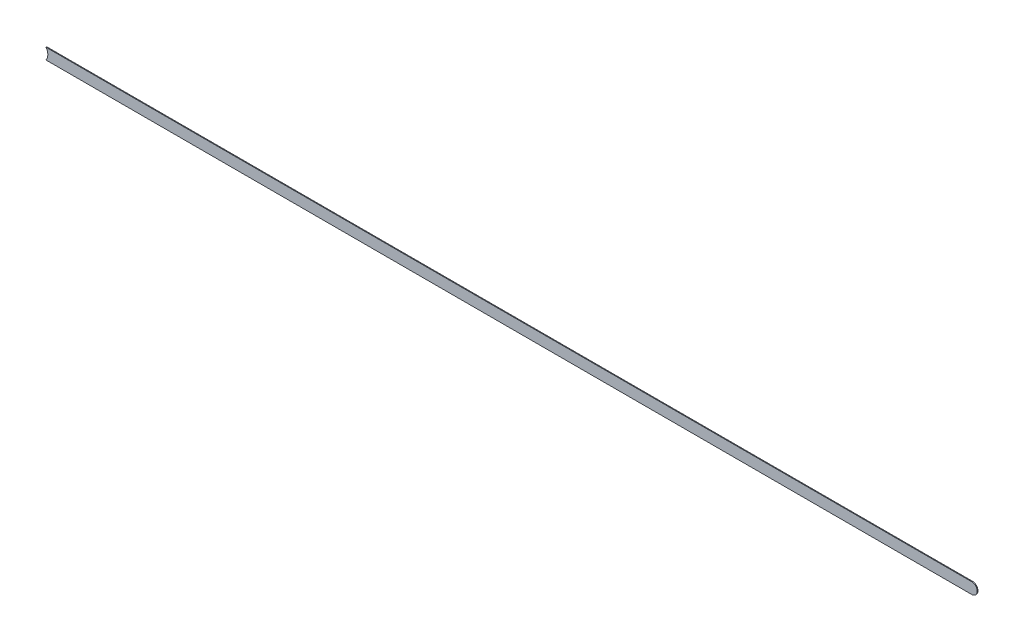
ISO-10303-21;
HEADER;
FILE_DESCRIPTION(('STEP AP214'),'2;1');
FILE_NAME('part.step','',(''),(''),'','','');
FILE_SCHEMA(('AUTOMOTIVE_DESIGN { 1 0 10303 214 1 1 1 1 }'));
ENDSEC;
DATA;
#1=APPLICATION_CONTEXT('core data for automotive mechanical design processes');
#2=APPLICATION_PROTOCOL_DEFINITION('international standard','automotive_design',2000,#1);
#3=PRODUCT_CONTEXT('',#1,'mechanical');
#4=PRODUCT('Part','Part','',(#3));
#5=PRODUCT_RELATED_PRODUCT_CATEGORY('part','',(#4));
#6=PRODUCT_DEFINITION_FORMATION('','',#4);
#7=PRODUCT_DEFINITION_CONTEXT('part definition',#1,'design');
#8=PRODUCT_DEFINITION('design','',#6,#7);
#9=PRODUCT_DEFINITION_SHAPE('','',#8);
#10=(LENGTH_UNIT() NAMED_UNIT(*) SI_UNIT(.MILLI.,.METRE.));
#11=(NAMED_UNIT(*) PLANE_ANGLE_UNIT() SI_UNIT($,.RADIAN.));
#12=(NAMED_UNIT(*) SI_UNIT($,.STERADIAN.) SOLID_ANGLE_UNIT());
#13=UNCERTAINTY_MEASURE_WITH_UNIT(LENGTH_MEASURE(1.E-05),#10,'distance_accuracy_value','');
#14=(GEOMETRIC_REPRESENTATION_CONTEXT(3) GLOBAL_UNCERTAINTY_ASSIGNED_CONTEXT((#13)) GLOBAL_UNIT_ASSIGNED_CONTEXT((#10,
#11,#12)) REPRESENTATION_CONTEXT('',''));
#15=CARTESIAN_POINT('',(0.,0.,0.));
#16=DIRECTION('',(0.,0.,1.));
#17=DIRECTION('',(1.,0.,0.));
#18=AXIS2_PLACEMENT_3D('',#15,#16,#17);
#19=CARTESIAN_POINT('',(120.645,-153.499,-0.035));
#20=DIRECTION('',(0.,1.,0.));
#21=DIRECTION('',(1.,0.,0.));
#22=AXIS2_PLACEMENT_3D('',#19,#20,#21);
#23=PLANE('',#22);
#24=DIRECTION('',(0.,0.,1.));
#25=VECTOR('',#24,1.);
#26=CARTESIAN_POINT('',(162.727,-153.499,-0.035));
#27=LINE('',#26,#25);
#28=CARTESIAN_POINT('',(162.727,-153.499,-0.035));
#29=VERTEX_POINT('',#28);
#30=CARTESIAN_POINT('',(162.727,-153.499,0.));
#31=VERTEX_POINT('',#30);
#32=EDGE_CURVE('E11',#29,#31,#27,.T.);
#33=ORIENTED_EDGE('',*,*,#32,.T.);
#34=DIRECTION('',(1.,0.,0.));
#35=VECTOR('',#34,1.);
#36=CARTESIAN_POINT('',(120.645,-153.499,0.));
#37=LINE('',#36,#35);
#38=CARTESIAN_POINT('',(120.98869317713,-153.499,0.));
#39=VERTEX_POINT('',#38);
#40=EDGE_CURVE('E25',#39,#31,#37,.T.);
#41=ORIENTED_EDGE('',*,*,#40,.F.);
#42=DIRECTION('',(0.,0.,-1.));
#43=VECTOR('',#42,1.);
#44=CARTESIAN_POINT('',(120.98869317712,-153.499,-0.045));
#45=LINE('',#44,#43);
#46=CARTESIAN_POINT('',(120.98869317713,-153.499,-0.035));
#47=VERTEX_POINT('',#46);
#48=EDGE_CURVE('E64',#39,#47,#45,.T.);
#49=ORIENTED_EDGE('',*,*,#48,.T.);
#50=DIRECTION('',(1.,0.,0.));
#51=VECTOR('',#50,1.);
#52=CARTESIAN_POINT('',(120.645,-153.499,-0.035));
#53=LINE('',#52,#51);
#54=EDGE_CURVE('E67',#47,#29,#53,.T.);
#55=ORIENTED_EDGE('',*,*,#54,.T.);
#56=EDGE_LOOP('',(#33,#41,#49,#55));
#57=FACE_BOUND('',#56,.T.);
#58=ADVANCED_FACE('F17',(#57),#23,.F.);
#59=CARTESIAN_POINT('',(162.727,-153.249,-0.035));
#60=DIRECTION('',(0.,0.,-1.));
#61=DIRECTION('',(0.,-1.,0.));
#62=AXIS2_PLACEMENT_3D('',#59,#60,#61);
#63=CYLINDRICAL_SURFACE('',#62,0.25);
#64=CARTESIAN_POINT('',(162.727,-153.249,-0.035));
#65=DIRECTION('',(0.,0.,1.));
#66=DIRECTION('',(0.,-1.,0.));
#67=AXIS2_PLACEMENT_3D('',#64,#65,#66);
#68=CIRCLE('',#67,0.25);
#69=CARTESIAN_POINT('',(162.727,-152.999,-0.035));
#70=VERTEX_POINT('',#69);
#71=EDGE_CURVE('E83',#29,#70,#68,.T.);
#72=ORIENTED_EDGE('',*,*,#71,.T.);
#73=DIRECTION('',(0.,0.,1.));
#74=VECTOR('',#73,1.);
#75=CARTESIAN_POINT('',(162.727,-152.999,-0.035));
#76=LINE('',#75,#74);
#77=CARTESIAN_POINT('',(162.727,-152.999,0.));
#78=VERTEX_POINT('',#77);
#79=EDGE_CURVE('E94',#70,#78,#76,.T.);
#80=ORIENTED_EDGE('',*,*,#79,.T.);
#81=CARTESIAN_POINT('',(162.727,-153.249,0.));
#82=DIRECTION('',(0.,0.,1.));
#83=DIRECTION('',(0.,-1.,0.));
#84=AXIS2_PLACEMENT_3D('',#81,#82,#83);
#85=CIRCLE('',#84,0.25);
#86=EDGE_CURVE('E71',#31,#78,#85,.T.);
#87=ORIENTED_EDGE('',*,*,#86,.F.);
#88=ORIENTED_EDGE('',*,*,#32,.F.);
#89=EDGE_LOOP('',(#72,#80,#87,#88));
#90=FACE_BOUND('',#89,.T.);
#91=ADVANCED_FACE('F115',(#90),#63,.T.);
#92=CARTESIAN_POINT('',(162.727,-152.999,0.));
#93=DIRECTION('',(0.,0.,1.));
#94=DIRECTION('',(1.,0.,0.));
#95=AXIS2_PLACEMENT_3D('',#92,#93,#94);
#96=PLANE('',#95);
#97=ORIENTED_EDGE('',*,*,#86,.T.);
#98=DIRECTION('',(-1.,0.,0.));
#99=VECTOR('',#98,1.);
#100=CARTESIAN_POINT('',(162.727,-152.999,0.));
#101=LINE('',#100,#99);
#102=CARTESIAN_POINT('',(120.98869317711,-152.999,0.));
#103=VERTEX_POINT('',#102);
#104=EDGE_CURVE('E112',#78,#103,#101,.T.);
#105=ORIENTED_EDGE('',*,*,#104,.T.);
#106=CARTESIAN_POINT('',(120.645,-153.249,0.));
#107=DIRECTION('',(0.,0.,-1.));
#108=DIRECTION('',(0.,-1.,0.));
#109=AXIS2_PLACEMENT_3D('',#106,#107,#108);
#110=CIRCLE('',#109,0.425);
#111=EDGE_CURVE('E72',#103,#39,#110,.T.);
#112=ORIENTED_EDGE('',*,*,#111,.T.);
#113=ORIENTED_EDGE('',*,*,#40,.T.);
#114=EDGE_LOOP('',(#97,#105,#112,#113));
#115=FACE_BOUND('',#114,.T.);
#116=ADVANCED_FACE('F110',(#115),#96,.T.);
#117=CARTESIAN_POINT('',(120.645,-153.249,-0.045));
#118=DIRECTION('',(0.,0.,-1.));
#119=DIRECTION('',(0.,-1.,0.));
#120=AXIS2_PLACEMENT_3D('',#117,#118,#119);
#121=CYLINDRICAL_SURFACE('',#120,0.425);
#122=ORIENTED_EDGE('',*,*,#111,.F.);
#123=DIRECTION('',(0.,0.,-1.));
#124=VECTOR('',#123,1.);
#125=CARTESIAN_POINT('',(120.98869317712,-152.999,-0.045));
#126=LINE('',#125,#124);
#127=CARTESIAN_POINT('',(120.98869317711,-152.999,-0.035));
#128=VERTEX_POINT('',#127);
#129=EDGE_CURVE('E78',#103,#128,#126,.T.);
#130=ORIENTED_EDGE('',*,*,#129,.T.);
#131=CARTESIAN_POINT('',(120.645,-153.249,-0.035));
#132=DIRECTION('',(0.,0.,-1.));
#133=DIRECTION('',(0.,-1.,0.));
#134=AXIS2_PLACEMENT_3D('',#131,#132,#133);
#135=CIRCLE('',#134,0.425);
#136=EDGE_CURVE('E75',#128,#47,#135,.T.);
#137=ORIENTED_EDGE('',*,*,#136,.T.);
#138=ORIENTED_EDGE('',*,*,#48,.F.);
#139=EDGE_LOOP('',(#122,#130,#137,#138));
#140=FACE_BOUND('',#139,.T.);
#141=ADVANCED_FACE('F76',(#140),#121,.F.);
#142=CARTESIAN_POINT('',(162.727,-152.999,-0.035));
#143=DIRECTION('',(0.,0.,1.));
#144=DIRECTION('',(1.,0.,0.));
#145=AXIS2_PLACEMENT_3D('',#142,#143,#144);
#146=PLANE('',#145);
#147=ORIENTED_EDGE('',*,*,#54,.F.);
#148=ORIENTED_EDGE('',*,*,#136,.F.);
#149=DIRECTION('',(-1.,0.,0.));
#150=VECTOR('',#149,1.);
#151=CARTESIAN_POINT('',(162.727,-152.999,-0.035));
#152=LINE('',#151,#150);
#153=EDGE_CURVE('E88',#70,#128,#152,.T.);
#154=ORIENTED_EDGE('',*,*,#153,.F.);
#155=ORIENTED_EDGE('',*,*,#71,.F.);
#156=EDGE_LOOP('',(#147,#148,#154,#155));
#157=FACE_BOUND('',#156,.T.);
#158=ADVANCED_FACE('F86',(#157),#146,.F.);
#159=CARTESIAN_POINT('',(162.727,-152.999,-0.035));
#160=DIRECTION('',(0.,-1.,0.));
#161=DIRECTION('',(0.,0.,-1.));
#162=AXIS2_PLACEMENT_3D('',#159,#160,#161);
#163=PLANE('',#162);
#164=ORIENTED_EDGE('',*,*,#129,.F.);
#165=ORIENTED_EDGE('',*,*,#104,.F.);
#166=ORIENTED_EDGE('',*,*,#79,.F.);
#167=ORIENTED_EDGE('',*,*,#153,.T.);
#168=EDGE_LOOP('',(#164,#165,#166,#167));
#169=FACE_BOUND('',#168,.T.);
#170=ADVANCED_FACE('F118',(#169),#163,.F.);
#171=CLOSED_SHELL('',(#58,#91,#116,#141,#158,#170));
#172=MANIFOLD_SOLID_BREP('B1',#171);
#173=ADVANCED_BREP_SHAPE_REPRESENTATION('',(#18,#172),#14);
#174=SHAPE_DEFINITION_REPRESENTATION(#9,#173);
ENDSEC;
END-ISO-10303-21;
